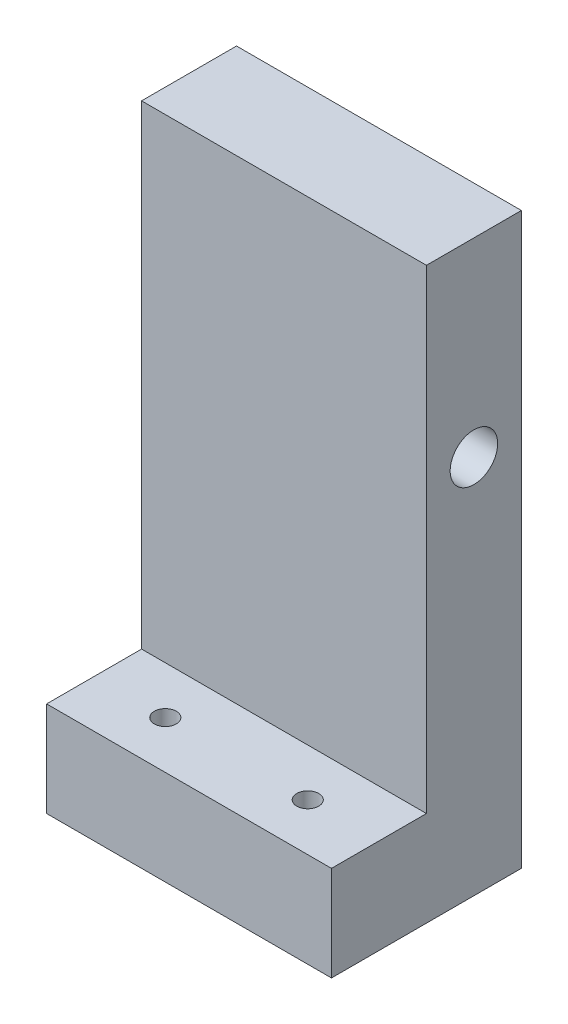
ISO-10303-21;
HEADER;
FILE_DESCRIPTION(('STEP AP214'),'2;1');
FILE_NAME('part.step','',(''),(''),'','','');
FILE_SCHEMA(('AUTOMOTIVE_DESIGN { 1 0 10303 214 1 1 1 1 }'));
ENDSEC;
DATA;
#1=APPLICATION_CONTEXT('core data for automotive mechanical design processes');
#2=APPLICATION_PROTOCOL_DEFINITION('international standard','automotive_design',2000,#1);
#3=PRODUCT_CONTEXT('',#1,'mechanical');
#4=PRODUCT('Part','Part','',(#3));
#5=PRODUCT_RELATED_PRODUCT_CATEGORY('part','',(#4));
#6=PRODUCT_DEFINITION_FORMATION('','',#4);
#7=PRODUCT_DEFINITION_CONTEXT('part definition',#1,'design');
#8=PRODUCT_DEFINITION('design','',#6,#7);
#9=PRODUCT_DEFINITION_SHAPE('','',#8);
#10=(LENGTH_UNIT() NAMED_UNIT(*) SI_UNIT(.MILLI.,.METRE.));
#11=(NAMED_UNIT(*) PLANE_ANGLE_UNIT() SI_UNIT($,.RADIAN.));
#12=(NAMED_UNIT(*) SI_UNIT($,.STERADIAN.) SOLID_ANGLE_UNIT());
#13=UNCERTAINTY_MEASURE_WITH_UNIT(LENGTH_MEASURE(1.E-05),#10,'distance_accuracy_value','');
#14=(GEOMETRIC_REPRESENTATION_CONTEXT(3) GLOBAL_UNCERTAINTY_ASSIGNED_CONTEXT((#13)) GLOBAL_UNIT_ASSIGNED_CONTEXT((#10,
#11,#12)) REPRESENTATION_CONTEXT('',''));
#15=CARTESIAN_POINT('',(0.,0.,0.));
#16=DIRECTION('',(0.,0.,1.));
#17=DIRECTION('',(1.,0.,0.));
#18=AXIS2_PLACEMENT_3D('',#15,#16,#17);
#19=CARTESIAN_POINT('',(38.1,0.,0.));
#20=DIRECTION('',(0.,1.,0.));
#21=DIRECTION('',(0.,0.,1.));
#22=AXIS2_PLACEMENT_3D('',#19,#20,#21);
#23=PLANE('',#22);
#24=CARTESIAN_POINT('',(9.525,0.,-6.35));
#25=DIRECTION('',(0.,1.,0.));
#26=DIRECTION('',(0.,0.,1.));
#27=AXIS2_PLACEMENT_3D('',#24,#25,#26);
#28=CIRCLE('',#27,1.4732);
#29=CARTESIAN_POINT('',(9.525,0.,-4.8768));
#30=VERTEX_POINT('',#29);
#31=EDGE_CURVE('E161',#30,#30,#28,.T.);
#32=ORIENTED_EDGE('',*,*,#31,.T.);
#33=EDGE_LOOP('',(#32));
#34=FACE_BOUND('',#33,.T.);
#35=CARTESIAN_POINT('',(28.575,0.,-6.35));
#36=DIRECTION('',(0.,1.,0.));
#37=DIRECTION('',(0.,0.,1.));
#38=AXIS2_PLACEMENT_3D('',#35,#36,#37);
#39=CIRCLE('',#38,1.4732);
#40=CARTESIAN_POINT('',(28.575,0.,-4.8768));
#41=VERTEX_POINT('',#40);
#42=EDGE_CURVE('E164',#41,#41,#39,.T.);
#43=ORIENTED_EDGE('',*,*,#42,.T.);
#44=EDGE_LOOP('',(#43));
#45=FACE_BOUND('',#44,.T.);
#46=DIRECTION('',(0.,0.,-1.));
#47=VECTOR('',#46,1.);
#48=CARTESIAN_POINT('',(0.,0.,0.));
#49=LINE('',#48,#47);
#50=CARTESIAN_POINT('',(0.,0.,0.));
#51=VERTEX_POINT('',#50);
#52=CARTESIAN_POINT('',(0.,0.,-25.4));
#53=VERTEX_POINT('',#52);
#54=EDGE_CURVE('E116',#51,#53,#49,.T.);
#55=ORIENTED_EDGE('',*,*,#54,.T.);
#56=DIRECTION('',(-1.,0.,0.));
#57=VECTOR('',#56,1.);
#58=CARTESIAN_POINT('',(38.1,0.,-25.4));
#59=LINE('',#58,#57);
#60=CARTESIAN_POINT('',(38.1,0.,-25.4));
#61=VERTEX_POINT('',#60);
#62=EDGE_CURVE('E11',#61,#53,#59,.T.);
#63=ORIENTED_EDGE('',*,*,#62,.F.);
#64=DIRECTION('',(0.,0.,-1.));
#65=VECTOR('',#64,1.);
#66=CARTESIAN_POINT('',(38.1,0.,0.));
#67=LINE('',#66,#65);
#68=CARTESIAN_POINT('',(38.1,0.,0.));
#69=VERTEX_POINT('',#68);
#70=EDGE_CURVE('E127',#69,#61,#67,.T.);
#71=ORIENTED_EDGE('',*,*,#70,.F.);
#72=DIRECTION('',(-1.,0.,0.));
#73=VECTOR('',#72,1.);
#74=CARTESIAN_POINT('',(38.1,0.,0.));
#75=LINE('',#74,#73);
#76=EDGE_CURVE('E112',#69,#51,#75,.T.);
#77=ORIENTED_EDGE('',*,*,#76,.T.);
#78=EDGE_LOOP('',(#55,#63,#71,#77));
#79=FACE_BOUND('',#78,.T.);
#80=ADVANCED_FACE('F32',(#34,#45,#79),#23,.F.);
#81=CARTESIAN_POINT('',(38.1,0.,-25.4));
#82=DIRECTION('',(0.,0.,1.));
#83=DIRECTION('',(0.,-1.,0.));
#84=AXIS2_PLACEMENT_3D('',#81,#82,#83);
#85=PLANE('',#84);
#86=DIRECTION('',(0.,1.,0.));
#87=VECTOR('',#86,1.);
#88=CARTESIAN_POINT('',(0.,0.,-25.4));
#89=LINE('',#88,#87);
#90=CARTESIAN_POINT('',(0.,76.2,-25.4));
#91=VERTEX_POINT('',#90);
#92=EDGE_CURVE('E119',#53,#91,#89,.T.);
#93=ORIENTED_EDGE('',*,*,#92,.T.);
#94=DIRECTION('',(-1.,0.,0.));
#95=VECTOR('',#94,1.);
#96=CARTESIAN_POINT('',(38.1,76.2,-25.4));
#97=LINE('',#96,#95);
#98=CARTESIAN_POINT('',(38.1,76.2,-25.4));
#99=VERTEX_POINT('',#98);
#100=EDGE_CURVE('E40',#99,#91,#97,.T.);
#101=ORIENTED_EDGE('',*,*,#100,.F.);
#102=DIRECTION('',(0.,1.,0.));
#103=VECTOR('',#102,1.);
#104=CARTESIAN_POINT('',(38.1,0.,-25.4));
#105=LINE('',#104,#103);
#106=EDGE_CURVE('E85',#61,#99,#105,.T.);
#107=ORIENTED_EDGE('',*,*,#106,.F.);
#108=ORIENTED_EDGE('',*,*,#62,.T.);
#109=EDGE_LOOP('',(#93,#101,#107,#108));
#110=FACE_BOUND('',#109,.T.);
#111=ADVANCED_FACE('F153',(#110),#85,.F.);
#112=CARTESIAN_POINT('',(38.1,76.2,-25.4));
#113=DIRECTION('',(0.,-1.,0.));
#114=DIRECTION('',(0.,0.,-1.));
#115=AXIS2_PLACEMENT_3D('',#112,#113,#114);
#116=PLANE('',#115);
#117=DIRECTION('',(0.,0.,1.));
#118=VECTOR('',#117,1.);
#119=CARTESIAN_POINT('',(0.,76.2,-25.4));
#120=LINE('',#119,#118);
#121=CARTESIAN_POINT('',(0.,76.2,-12.7));
#122=VERTEX_POINT('',#121);
#123=EDGE_CURVE('E122',#91,#122,#120,.T.);
#124=ORIENTED_EDGE('',*,*,#123,.T.);
#125=DIRECTION('',(-1.,0.,0.));
#126=VECTOR('',#125,1.);
#127=CARTESIAN_POINT('',(38.1,76.2,-12.7));
#128=LINE('',#127,#126);
#129=CARTESIAN_POINT('',(38.1,76.2,-12.7));
#130=VERTEX_POINT('',#129);
#131=EDGE_CURVE('E107',#130,#122,#128,.T.);
#132=ORIENTED_EDGE('',*,*,#131,.F.);
#133=DIRECTION('',(0.,0.,1.));
#134=VECTOR('',#133,1.);
#135=CARTESIAN_POINT('',(38.1,76.2,-25.4));
#136=LINE('',#135,#134);
#137=EDGE_CURVE('E98',#99,#130,#136,.T.);
#138=ORIENTED_EDGE('',*,*,#137,.F.);
#139=ORIENTED_EDGE('',*,*,#100,.T.);
#140=EDGE_LOOP('',(#124,#132,#138,#139));
#141=FACE_BOUND('',#140,.T.);
#142=ADVANCED_FACE('F133',(#141),#116,.F.);
#143=CARTESIAN_POINT('',(38.1,76.2,-12.7));
#144=DIRECTION('',(0.,0.,-1.));
#145=DIRECTION('',(0.,1.,0.));
#146=AXIS2_PLACEMENT_3D('',#143,#144,#145);
#147=PLANE('',#146);
#148=DIRECTION('',(0.,-1.,0.));
#149=VECTOR('',#148,1.);
#150=CARTESIAN_POINT('',(0.,76.2,-12.7));
#151=LINE('',#150,#149);
#152=CARTESIAN_POINT('',(0.,12.7,-12.7));
#153=VERTEX_POINT('',#152);
#154=EDGE_CURVE('E106',#122,#153,#151,.T.);
#155=ORIENTED_EDGE('',*,*,#154,.T.);
#156=DIRECTION('',(-1.,0.,0.));
#157=VECTOR('',#156,1.);
#158=CARTESIAN_POINT('',(38.1,12.7,-12.7));
#159=LINE('',#158,#157);
#160=CARTESIAN_POINT('',(38.1,12.7,-12.7));
#161=VERTEX_POINT('',#160);
#162=EDGE_CURVE('E103',#161,#153,#159,.T.);
#163=ORIENTED_EDGE('',*,*,#162,.F.);
#164=DIRECTION('',(0.,-1.,0.));
#165=VECTOR('',#164,1.);
#166=CARTESIAN_POINT('',(38.1,76.2,-12.7));
#167=LINE('',#166,#165);
#168=EDGE_CURVE('E92',#130,#161,#167,.T.);
#169=ORIENTED_EDGE('',*,*,#168,.F.);
#170=ORIENTED_EDGE('',*,*,#131,.T.);
#171=EDGE_LOOP('',(#155,#163,#169,#170));
#172=FACE_BOUND('',#171,.T.);
#173=ADVANCED_FACE('F104',(#172),#147,.F.);
#174=CARTESIAN_POINT('',(38.1,12.7,0.));
#175=DIRECTION('',(0.,-1.,0.));
#176=DIRECTION('',(0.,0.,-1.));
#177=AXIS2_PLACEMENT_3D('',#174,#175,#176);
#178=PLANE('',#177);
#179=CARTESIAN_POINT('',(9.525,12.7,-6.35));
#180=DIRECTION('',(0.,1.,0.));
#181=DIRECTION('',(0.,0.,1.));
#182=AXIS2_PLACEMENT_3D('',#179,#180,#181);
#183=CIRCLE('',#182,1.4732);
#184=CARTESIAN_POINT('',(9.525,12.7,-4.8768));
#185=VERTEX_POINT('',#184);
#186=EDGE_CURVE('E166',#185,#185,#183,.T.);
#187=ORIENTED_EDGE('',*,*,#186,.F.);
#188=EDGE_LOOP('',(#187));
#189=FACE_BOUND('',#188,.T.);
#190=CARTESIAN_POINT('',(28.575,12.7,-6.35));
#191=DIRECTION('',(0.,1.,0.));
#192=DIRECTION('',(0.,0.,1.));
#193=AXIS2_PLACEMENT_3D('',#190,#191,#192);
#194=CIRCLE('',#193,1.4732);
#195=CARTESIAN_POINT('',(28.575,12.7,-4.8768));
#196=VERTEX_POINT('',#195);
#197=EDGE_CURVE('E167',#196,#196,#194,.T.);
#198=ORIENTED_EDGE('',*,*,#197,.F.);
#199=EDGE_LOOP('',(#198));
#200=FACE_BOUND('',#199,.T.);
#201=DIRECTION('',(0.,0.,1.));
#202=VECTOR('',#201,1.);
#203=CARTESIAN_POINT('',(0.,12.7,0.));
#204=LINE('',#203,#202);
#205=CARTESIAN_POINT('',(0.,12.7,0.));
#206=VERTEX_POINT('',#205);
#207=EDGE_CURVE('E71',#153,#206,#204,.T.);
#208=ORIENTED_EDGE('',*,*,#207,.T.);
#209=DIRECTION('',(-1.,0.,0.));
#210=VECTOR('',#209,1.);
#211=CARTESIAN_POINT('',(38.1,12.7,0.));
#212=LINE('',#211,#210);
#213=CARTESIAN_POINT('',(38.1,12.7,0.));
#214=VERTEX_POINT('',#213);
#215=EDGE_CURVE('E108',#214,#206,#212,.T.);
#216=ORIENTED_EDGE('',*,*,#215,.F.);
#217=DIRECTION('',(0.,0.,1.));
#218=VECTOR('',#217,1.);
#219=CARTESIAN_POINT('',(38.1,12.7,0.));
#220=LINE('',#219,#218);
#221=EDGE_CURVE('E96',#161,#214,#220,.T.);
#222=ORIENTED_EDGE('',*,*,#221,.F.);
#223=ORIENTED_EDGE('',*,*,#162,.T.);
#224=EDGE_LOOP('',(#208,#216,#222,#223));
#225=FACE_BOUND('',#224,.T.);
#226=ADVANCED_FACE('F110',(#189,#200,#225),#178,.F.);
#227=CARTESIAN_POINT('',(38.1,0.,0.));
#228=DIRECTION('',(0.,0.,-1.));
#229=DIRECTION('',(-1.,0.,0.));
#230=AXIS2_PLACEMENT_3D('',#227,#228,#229);
#231=PLANE('',#230);
#232=DIRECTION('',(0.,-1.,0.));
#233=VECTOR('',#232,1.);
#234=CARTESIAN_POINT('',(0.,0.,0.));
#235=LINE('',#234,#233);
#236=EDGE_CURVE('E77',#206,#51,#235,.T.);
#237=ORIENTED_EDGE('',*,*,#236,.T.);
#238=ORIENTED_EDGE('',*,*,#76,.F.);
#239=DIRECTION('',(0.,-1.,0.));
#240=VECTOR('',#239,1.);
#241=CARTESIAN_POINT('',(38.1,0.,0.));
#242=LINE('',#241,#240);
#243=EDGE_CURVE('E48',#214,#69,#242,.T.);
#244=ORIENTED_EDGE('',*,*,#243,.F.);
#245=ORIENTED_EDGE('',*,*,#215,.T.);
#246=EDGE_LOOP('',(#237,#238,#244,#245));
#247=FACE_BOUND('',#246,.T.);
#248=ADVANCED_FACE('F140',(#247),#231,.F.);
#249=CARTESIAN_POINT('',(38.1,0.,0.));
#250=DIRECTION('',(1.,0.,0.));
#251=DIRECTION('',(0.,0.,-1.));
#252=AXIS2_PLACEMENT_3D('',#249,#250,#251);
#253=PLANE('',#252);
#254=CARTESIAN_POINT('',(38.1,50.8,-19.05));
#255=DIRECTION('',(1.,0.,0.));
#256=DIRECTION('',(0.,0.,-1.));
#257=AXIS2_PLACEMENT_3D('',#254,#255,#256);
#258=CIRCLE('',#257,3.175);
#259=CARTESIAN_POINT('',(38.1,50.8,-22.225));
#260=VERTEX_POINT('',#259);
#261=EDGE_CURVE('E177',#260,#260,#258,.T.);
#262=ORIENTED_EDGE('',*,*,#261,.F.);
#263=EDGE_LOOP('',(#262));
#264=FACE_BOUND('',#263,.T.);
#265=ORIENTED_EDGE('',*,*,#70,.T.);
#266=ORIENTED_EDGE('',*,*,#106,.T.);
#267=ORIENTED_EDGE('',*,*,#137,.T.);
#268=ORIENTED_EDGE('',*,*,#168,.T.);
#269=ORIENTED_EDGE('',*,*,#221,.T.);
#270=ORIENTED_EDGE('',*,*,#243,.T.);
#271=EDGE_LOOP('',(#265,#266,#267,#268,#269,#270));
#272=FACE_BOUND('',#271,.T.);
#273=ADVANCED_FACE('F94',(#264,#272),#253,.T.);
#274=CARTESIAN_POINT('',(0.,0.,0.));
#275=DIRECTION('',(1.,0.,0.));
#276=DIRECTION('',(0.,0.,-1.));
#277=AXIS2_PLACEMENT_3D('',#274,#275,#276);
#278=PLANE('',#277);
#279=CARTESIAN_POINT('',(0.,50.8,-19.05));
#280=DIRECTION('',(1.,0.,0.));
#281=DIRECTION('',(0.,0.,-1.));
#282=AXIS2_PLACEMENT_3D('',#279,#280,#281);
#283=CIRCLE('',#282,3.175);
#284=CARTESIAN_POINT('',(0.,50.8,-22.225));
#285=VERTEX_POINT('',#284);
#286=EDGE_CURVE('E120',#285,#285,#283,.T.);
#287=ORIENTED_EDGE('',*,*,#286,.T.);
#288=EDGE_LOOP('',(#287));
#289=FACE_BOUND('',#288,.T.);
#290=ORIENTED_EDGE('',*,*,#54,.F.);
#291=ORIENTED_EDGE('',*,*,#236,.F.);
#292=ORIENTED_EDGE('',*,*,#207,.F.);
#293=ORIENTED_EDGE('',*,*,#154,.F.);
#294=ORIENTED_EDGE('',*,*,#123,.F.);
#295=ORIENTED_EDGE('',*,*,#92,.F.);
#296=EDGE_LOOP('',(#290,#291,#292,#293,#294,#295));
#297=FACE_BOUND('',#296,.T.);
#298=ADVANCED_FACE('F136',(#289,#297),#278,.F.);
#299=CARTESIAN_POINT('',(0.,50.8,-19.05));
#300=DIRECTION('',(1.,0.,0.));
#301=DIRECTION('',(0.,0.,-1.));
#302=AXIS2_PLACEMENT_3D('',#299,#300,#301);
#303=CYLINDRICAL_SURFACE('',#302,3.175);
#304=ORIENTED_EDGE('',*,*,#286,.F.);
#305=EDGE_LOOP('',(#304));
#306=FACE_BOUND('',#305,.T.);
#307=ORIENTED_EDGE('',*,*,#261,.T.);
#308=EDGE_LOOP('',(#307));
#309=FACE_BOUND('',#308,.T.);
#310=ADVANCED_FACE('F183',(#306,#309),#303,.F.);
#311=CARTESIAN_POINT('',(28.575,0.,-6.35));
#312=DIRECTION('',(0.,1.,0.));
#313=DIRECTION('',(0.,0.,1.));
#314=AXIS2_PLACEMENT_3D('',#311,#312,#313);
#315=CYLINDRICAL_SURFACE('',#314,1.4732);
#316=ORIENTED_EDGE('',*,*,#42,.F.);
#317=EDGE_LOOP('',(#316));
#318=FACE_BOUND('',#317,.T.);
#319=ORIENTED_EDGE('',*,*,#197,.T.);
#320=EDGE_LOOP('',(#319));
#321=FACE_BOUND('',#320,.T.);
#322=ADVANCED_FACE('F185',(#318,#321),#315,.F.);
#323=CARTESIAN_POINT('',(9.525,0.,-6.35));
#324=DIRECTION('',(0.,1.,0.));
#325=DIRECTION('',(0.,0.,1.));
#326=AXIS2_PLACEMENT_3D('',#323,#324,#325);
#327=CYLINDRICAL_SURFACE('',#326,1.4732);
#328=ORIENTED_EDGE('',*,*,#31,.F.);
#329=EDGE_LOOP('',(#328));
#330=FACE_BOUND('',#329,.T.);
#331=ORIENTED_EDGE('',*,*,#186,.T.);
#332=EDGE_LOOP('',(#331));
#333=FACE_BOUND('',#332,.T.);
#334=ADVANCED_FACE('F192',(#330,#333),#327,.F.);
#335=CLOSED_SHELL('',(#80,#111,#142,#173,#226,#248,#273,#298,#310,#322,#334));
#336=MANIFOLD_SOLID_BREP('B2',#335);
#337=ADVANCED_BREP_SHAPE_REPRESENTATION('',(#18,#336),#14);
#338=SHAPE_DEFINITION_REPRESENTATION(#9,#337);
ENDSEC;
END-ISO-10303-21;
